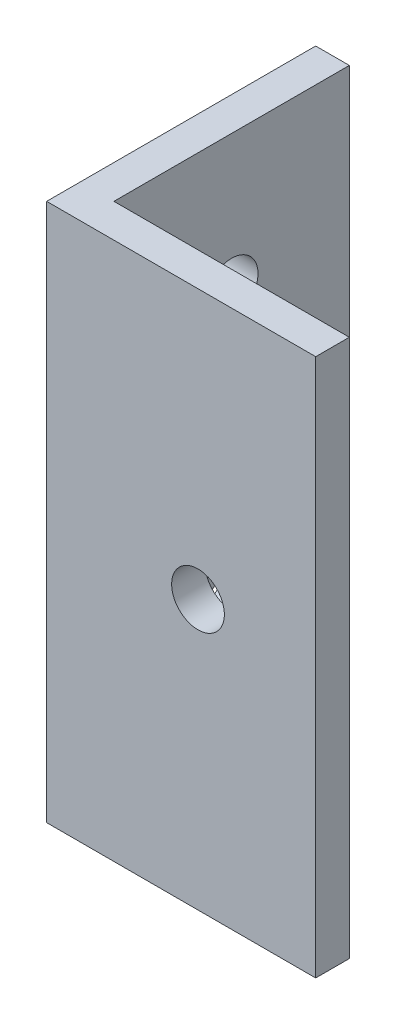
ISO-10303-21;
HEADER;
FILE_DESCRIPTION(('STEP AP214'),'2;1');
FILE_NAME('part.step','',(''),(''),'','','');
FILE_SCHEMA(('AUTOMOTIVE_DESIGN { 1 0 10303 214 1 1 1 1 }'));
ENDSEC;
DATA;
#1=APPLICATION_CONTEXT('core data for automotive mechanical design processes');
#2=APPLICATION_PROTOCOL_DEFINITION('international standard','automotive_design',2000,#1);
#3=PRODUCT_CONTEXT('',#1,'mechanical');
#4=PRODUCT('Part','Part','',(#3));
#5=PRODUCT_RELATED_PRODUCT_CATEGORY('part','',(#4));
#6=PRODUCT_DEFINITION_FORMATION('','',#4);
#7=PRODUCT_DEFINITION_CONTEXT('part definition',#1,'design');
#8=PRODUCT_DEFINITION('design','',#6,#7);
#9=PRODUCT_DEFINITION_SHAPE('','',#8);
#10=(LENGTH_UNIT() NAMED_UNIT(*) SI_UNIT(.MILLI.,.METRE.));
#11=(NAMED_UNIT(*) PLANE_ANGLE_UNIT() SI_UNIT($,.RADIAN.));
#12=(NAMED_UNIT(*) SI_UNIT($,.STERADIAN.) SOLID_ANGLE_UNIT());
#13=UNCERTAINTY_MEASURE_WITH_UNIT(LENGTH_MEASURE(1.E-05),#10,'distance_accuracy_value','');
#14=(GEOMETRIC_REPRESENTATION_CONTEXT(3) GLOBAL_UNCERTAINTY_ASSIGNED_CONTEXT((#13)) GLOBAL_UNIT_ASSIGNED_CONTEXT((#10,
#11,#12)) REPRESENTATION_CONTEXT('',''));
#15=CARTESIAN_POINT('',(0.,0.,0.));
#16=DIRECTION('',(0.,0.,1.));
#17=DIRECTION('',(1.,0.,0.));
#18=AXIS2_PLACEMENT_3D('',#15,#16,#17);
#19=CARTESIAN_POINT('',(0.,50.8,0.));
#20=DIRECTION('',(1.,0.,0.));
#21=DIRECTION('',(0.,0.,-1.));
#22=AXIS2_PLACEMENT_3D('',#19,#20,#21);
#23=PLANE('',#22);
#24=CARTESIAN_POINT('',(0.,12.7,-14.2875));
#25=DIRECTION('',(1.,0.,0.));
#26=DIRECTION('',(0.,0.,-1.));
#27=AXIS2_PLACEMENT_3D('',#24,#25,#26);
#28=CIRCLE('',#27,2.4892);
#29=CARTESIAN_POINT('',(0.,12.7,-16.7767));
#30=VERTEX_POINT('',#29);
#31=EDGE_CURVE('E162',#30,#30,#28,.T.);
#32=ORIENTED_EDGE('',*,*,#31,.T.);
#33=EDGE_LOOP('',(#32));
#34=FACE_BOUND('',#33,.T.);
#35=CARTESIAN_POINT('',(0.,38.1,-14.2875));
#36=DIRECTION('',(1.,0.,0.));
#37=DIRECTION('',(0.,0.,-1.));
#38=AXIS2_PLACEMENT_3D('',#35,#36,#37);
#39=CIRCLE('',#38,2.4892);
#40=CARTESIAN_POINT('',(0.,38.1,-16.7767));
#41=VERTEX_POINT('',#40);
#42=EDGE_CURVE('E165',#41,#41,#39,.T.);
#43=ORIENTED_EDGE('',*,*,#42,.T.);
#44=EDGE_LOOP('',(#43));
#45=FACE_BOUND('',#44,.T.);
#46=DIRECTION('',(0.,0.,1.));
#47=VECTOR('',#46,1.);
#48=CARTESIAN_POINT('',(0.,0.,0.));
#49=LINE('',#48,#47);
#50=CARTESIAN_POINT('',(0.,0.,-25.4));
#51=VERTEX_POINT('',#50);
#52=CARTESIAN_POINT('',(0.,0.,0.));
#53=VERTEX_POINT('',#52);
#54=EDGE_CURVE('E117',#51,#53,#49,.T.);
#55=ORIENTED_EDGE('',*,*,#54,.T.);
#56=DIRECTION('',(0.,-1.,0.));
#57=VECTOR('',#56,1.);
#58=CARTESIAN_POINT('',(0.,50.8,0.));
#59=LINE('',#58,#57);
#60=CARTESIAN_POINT('',(0.,50.8,0.));
#61=VERTEX_POINT('',#60);
#62=EDGE_CURVE('E11',#61,#53,#59,.T.);
#63=ORIENTED_EDGE('',*,*,#62,.F.);
#64=DIRECTION('',(0.,0.,1.));
#65=VECTOR('',#64,1.);
#66=CARTESIAN_POINT('',(0.,50.8,0.));
#67=LINE('',#66,#65);
#68=CARTESIAN_POINT('',(0.,50.8,-25.4));
#69=VERTEX_POINT('',#68);
#70=EDGE_CURVE('E128',#69,#61,#67,.T.);
#71=ORIENTED_EDGE('',*,*,#70,.F.);
#72=DIRECTION('',(0.,-1.,0.));
#73=VECTOR('',#72,1.);
#74=CARTESIAN_POINT('',(0.,50.8,-25.4));
#75=LINE('',#74,#73);
#76=EDGE_CURVE('E113',#69,#51,#75,.T.);
#77=ORIENTED_EDGE('',*,*,#76,.T.);
#78=EDGE_LOOP('',(#55,#63,#71,#77));
#79=FACE_BOUND('',#78,.T.);
#80=ADVANCED_FACE('F33',(#34,#45,#79),#23,.F.);
#81=CARTESIAN_POINT('',(0.,50.8,0.));
#82=DIRECTION('',(0.,0.,-1.));
#83=DIRECTION('',(-1.,0.,0.));
#84=AXIS2_PLACEMENT_3D('',#81,#82,#83);
#85=PLANE('',#84);
#86=CARTESIAN_POINT('',(14.2875,25.4,0.));
#87=DIRECTION('',(0.,0.,-1.));
#88=DIRECTION('',(-1.,0.,0.));
#89=AXIS2_PLACEMENT_3D('',#86,#87,#88);
#90=CIRCLE('',#89,2.4892);
#91=CARTESIAN_POINT('',(11.7983,25.4,0.));
#92=VERTEX_POINT('',#91);
#93=EDGE_CURVE('E121',#92,#92,#90,.T.);
#94=ORIENTED_EDGE('',*,*,#93,.T.);
#95=EDGE_LOOP('',(#94));
#96=FACE_BOUND('',#95,.T.);
#97=DIRECTION('',(1.,0.,0.));
#98=VECTOR('',#97,1.);
#99=CARTESIAN_POINT('',(0.,0.,0.));
#100=LINE('',#99,#98);
#101=CARTESIAN_POINT('',(25.4,0.,0.));
#102=VERTEX_POINT('',#101);
#103=EDGE_CURVE('E120',#53,#102,#100,.T.);
#104=ORIENTED_EDGE('',*,*,#103,.T.);
#105=DIRECTION('',(0.,-1.,0.));
#106=VECTOR('',#105,1.);
#107=CARTESIAN_POINT('',(25.4,50.8,0.));
#108=LINE('',#107,#106);
#109=CARTESIAN_POINT('',(25.4,50.8,0.));
#110=VERTEX_POINT('',#109);
#111=EDGE_CURVE('E41',#110,#102,#108,.T.);
#112=ORIENTED_EDGE('',*,*,#111,.F.);
#113=DIRECTION('',(1.,0.,0.));
#114=VECTOR('',#113,1.);
#115=CARTESIAN_POINT('',(0.,50.8,0.));
#116=LINE('',#115,#114);
#117=EDGE_CURVE('E86',#61,#110,#116,.T.);
#118=ORIENTED_EDGE('',*,*,#117,.F.);
#119=ORIENTED_EDGE('',*,*,#62,.T.);
#120=EDGE_LOOP('',(#104,#112,#118,#119));
#121=FACE_BOUND('',#120,.T.);
#122=ADVANCED_FACE('F153',(#96,#121),#85,.F.);
#123=CARTESIAN_POINT('',(25.4,50.8,0.));
#124=DIRECTION('',(-1.,0.,0.));
#125=DIRECTION('',(0.,0.,1.));
#126=AXIS2_PLACEMENT_3D('',#123,#124,#125);
#127=PLANE('',#126);
#128=DIRECTION('',(0.,0.,-1.));
#129=VECTOR('',#128,1.);
#130=CARTESIAN_POINT('',(25.4,0.,0.));
#131=LINE('',#130,#129);
#132=CARTESIAN_POINT('',(25.4,0.,-3.175));
#133=VERTEX_POINT('',#132);
#134=EDGE_CURVE('E123',#102,#133,#131,.T.);
#135=ORIENTED_EDGE('',*,*,#134,.T.);
#136=DIRECTION('',(0.,-1.,0.));
#137=VECTOR('',#136,1.);
#138=CARTESIAN_POINT('',(25.4,50.8,-3.175));
#139=LINE('',#138,#137);
#140=CARTESIAN_POINT('',(25.4,50.8,-3.175));
#141=VERTEX_POINT('',#140);
#142=EDGE_CURVE('E108',#141,#133,#139,.T.);
#143=ORIENTED_EDGE('',*,*,#142,.F.);
#144=DIRECTION('',(0.,0.,-1.));
#145=VECTOR('',#144,1.);
#146=CARTESIAN_POINT('',(25.4,50.8,0.));
#147=LINE('',#146,#145);
#148=EDGE_CURVE('E99',#110,#141,#147,.T.);
#149=ORIENTED_EDGE('',*,*,#148,.F.);
#150=ORIENTED_EDGE('',*,*,#111,.T.);
#151=EDGE_LOOP('',(#135,#143,#149,#150));
#152=FACE_BOUND('',#151,.T.);
#153=ADVANCED_FACE('F134',(#152),#127,.F.);
#154=CARTESIAN_POINT('',(3.175,50.8,-3.175));
#155=DIRECTION('',(0.,0.,1.));
#156=DIRECTION('',(1.,0.,0.));
#157=AXIS2_PLACEMENT_3D('',#154,#155,#156);
#158=PLANE('',#157);
#159=CARTESIAN_POINT('',(14.2875,25.4,-3.175));
#160=DIRECTION('',(0.,0.,-1.));
#161=DIRECTION('',(-1.,0.,0.));
#162=AXIS2_PLACEMENT_3D('',#159,#160,#161);
#163=CIRCLE('',#162,2.4892);
#164=CARTESIAN_POINT('',(11.7983,25.4,-3.175));
#165=VERTEX_POINT('',#164);
#166=EDGE_CURVE('E178',#165,#165,#163,.T.);
#167=ORIENTED_EDGE('',*,*,#166,.F.);
#168=EDGE_LOOP('',(#167));
#169=FACE_BOUND('',#168,.T.);
#170=DIRECTION('',(-1.,0.,0.));
#171=VECTOR('',#170,1.);
#172=CARTESIAN_POINT('',(3.175,0.,-3.175));
#173=LINE('',#172,#171);
#174=CARTESIAN_POINT('',(3.175,0.,-3.175));
#175=VERTEX_POINT('',#174);
#176=EDGE_CURVE('E107',#133,#175,#173,.T.);
#177=ORIENTED_EDGE('',*,*,#176,.T.);
#178=DIRECTION('',(0.,-1.,0.));
#179=VECTOR('',#178,1.);
#180=CARTESIAN_POINT('',(3.175,50.8,-3.175));
#181=LINE('',#180,#179);
#182=CARTESIAN_POINT('',(3.175,50.8,-3.175));
#183=VERTEX_POINT('',#182);
#184=EDGE_CURVE('E104',#183,#175,#181,.T.);
#185=ORIENTED_EDGE('',*,*,#184,.F.);
#186=DIRECTION('',(-1.,0.,0.));
#187=VECTOR('',#186,1.);
#188=CARTESIAN_POINT('',(3.175,50.8,-3.175));
#189=LINE('',#188,#187);
#190=EDGE_CURVE('E93',#141,#183,#189,.T.);
#191=ORIENTED_EDGE('',*,*,#190,.F.);
#192=ORIENTED_EDGE('',*,*,#142,.T.);
#193=EDGE_LOOP('',(#177,#185,#191,#192));
#194=FACE_BOUND('',#193,.T.);
#195=ADVANCED_FACE('F105',(#169,#194),#158,.F.);
#196=CARTESIAN_POINT('',(3.175,50.8,-3.175));
#197=DIRECTION('',(-1.,0.,0.));
#198=DIRECTION('',(0.,0.,1.));
#199=AXIS2_PLACEMENT_3D('',#196,#197,#198);
#200=PLANE('',#199);
#201=CARTESIAN_POINT('',(3.175,12.7,-14.2875));
#202=DIRECTION('',(1.,0.,0.));
#203=DIRECTION('',(0.,0.,-1.));
#204=AXIS2_PLACEMENT_3D('',#201,#202,#203);
#205=CIRCLE('',#204,2.4892);
#206=CARTESIAN_POINT('',(3.175,12.7,-16.7767));
#207=VERTEX_POINT('',#206);
#208=EDGE_CURVE('E167',#207,#207,#205,.T.);
#209=ORIENTED_EDGE('',*,*,#208,.F.);
#210=EDGE_LOOP('',(#209));
#211=FACE_BOUND('',#210,.T.);
#212=CARTESIAN_POINT('',(3.175,38.1,-14.2875));
#213=DIRECTION('',(1.,0.,0.));
#214=DIRECTION('',(0.,0.,-1.));
#215=AXIS2_PLACEMENT_3D('',#212,#213,#214);
#216=CIRCLE('',#215,2.4892);
#217=CARTESIAN_POINT('',(3.175,38.1,-16.7767));
#218=VERTEX_POINT('',#217);
#219=EDGE_CURVE('E168',#218,#218,#216,.T.);
#220=ORIENTED_EDGE('',*,*,#219,.F.);
#221=EDGE_LOOP('',(#220));
#222=FACE_BOUND('',#221,.T.);
#223=DIRECTION('',(0.,0.,-1.));
#224=VECTOR('',#223,1.);
#225=CARTESIAN_POINT('',(3.175,0.,-3.175));
#226=LINE('',#225,#224);
#227=CARTESIAN_POINT('',(3.175,0.,-25.4));
#228=VERTEX_POINT('',#227);
#229=EDGE_CURVE('E72',#175,#228,#226,.T.);
#230=ORIENTED_EDGE('',*,*,#229,.T.);
#231=DIRECTION('',(0.,-1.,0.));
#232=VECTOR('',#231,1.);
#233=CARTESIAN_POINT('',(3.175,50.8,-25.4));
#234=LINE('',#233,#232);
#235=CARTESIAN_POINT('',(3.175,50.8,-25.4));
#236=VERTEX_POINT('',#235);
#237=EDGE_CURVE('E109',#236,#228,#234,.T.);
#238=ORIENTED_EDGE('',*,*,#237,.F.);
#239=DIRECTION('',(0.,0.,-1.));
#240=VECTOR('',#239,1.);
#241=CARTESIAN_POINT('',(3.175,50.8,-3.175));
#242=LINE('',#241,#240);
#243=EDGE_CURVE('E97',#183,#236,#242,.T.);
#244=ORIENTED_EDGE('',*,*,#243,.F.);
#245=ORIENTED_EDGE('',*,*,#184,.T.);
#246=EDGE_LOOP('',(#230,#238,#244,#245));
#247=FACE_BOUND('',#246,.T.);
#248=ADVANCED_FACE('F111',(#211,#222,#247),#200,.F.);
#249=CARTESIAN_POINT('',(0.,50.8,-25.4));
#250=DIRECTION('',(0.,0.,1.));
#251=DIRECTION('',(1.,0.,0.));
#252=AXIS2_PLACEMENT_3D('',#249,#250,#251);
#253=PLANE('',#252);
#254=DIRECTION('',(-1.,0.,0.));
#255=VECTOR('',#254,1.);
#256=CARTESIAN_POINT('',(0.,0.,-25.4));
#257=LINE('',#256,#255);
#258=EDGE_CURVE('E78',#228,#51,#257,.T.);
#259=ORIENTED_EDGE('',*,*,#258,.T.);
#260=ORIENTED_EDGE('',*,*,#76,.F.);
#261=DIRECTION('',(-1.,0.,0.));
#262=VECTOR('',#261,1.);
#263=CARTESIAN_POINT('',(0.,50.8,-25.4));
#264=LINE('',#263,#262);
#265=EDGE_CURVE('E49',#236,#69,#264,.T.);
#266=ORIENTED_EDGE('',*,*,#265,.F.);
#267=ORIENTED_EDGE('',*,*,#237,.T.);
#268=EDGE_LOOP('',(#259,#260,#266,#267));
#269=FACE_BOUND('',#268,.T.);
#270=ADVANCED_FACE('F141',(#269),#253,.F.);
#271=CARTESIAN_POINT('',(0.,50.8,0.));
#272=DIRECTION('',(0.,-1.,0.));
#273=DIRECTION('',(0.,0.,-1.));
#274=AXIS2_PLACEMENT_3D('',#271,#272,#273);
#275=PLANE('',#274);
#276=ORIENTED_EDGE('',*,*,#70,.T.);
#277=ORIENTED_EDGE('',*,*,#117,.T.);
#278=ORIENTED_EDGE('',*,*,#148,.T.);
#279=ORIENTED_EDGE('',*,*,#190,.T.);
#280=ORIENTED_EDGE('',*,*,#243,.T.);
#281=ORIENTED_EDGE('',*,*,#265,.T.);
#282=EDGE_LOOP('',(#276,#277,#278,#279,#280,#281));
#283=FACE_BOUND('',#282,.T.);
#284=ADVANCED_FACE('F95',(#283),#275,.F.);
#285=CARTESIAN_POINT('',(0.,0.,0.));
#286=DIRECTION('',(0.,-1.,0.));
#287=DIRECTION('',(0.,0.,-1.));
#288=AXIS2_PLACEMENT_3D('',#285,#286,#287);
#289=PLANE('',#288);
#290=ORIENTED_EDGE('',*,*,#54,.F.);
#291=ORIENTED_EDGE('',*,*,#258,.F.);
#292=ORIENTED_EDGE('',*,*,#229,.F.);
#293=ORIENTED_EDGE('',*,*,#176,.F.);
#294=ORIENTED_EDGE('',*,*,#134,.F.);
#295=ORIENTED_EDGE('',*,*,#103,.F.);
#296=EDGE_LOOP('',(#290,#291,#292,#293,#294,#295));
#297=FACE_BOUND('',#296,.T.);
#298=ADVANCED_FACE('F137',(#297),#289,.T.);
#299=CARTESIAN_POINT('',(14.2875,25.4,0.));
#300=DIRECTION('',(0.,0.,-1.));
#301=DIRECTION('',(-1.,0.,0.));
#302=AXIS2_PLACEMENT_3D('',#299,#300,#301);
#303=CYLINDRICAL_SURFACE('',#302,2.4892);
#304=ORIENTED_EDGE('',*,*,#93,.F.);
#305=EDGE_LOOP('',(#304));
#306=FACE_BOUND('',#305,.T.);
#307=ORIENTED_EDGE('',*,*,#166,.T.);
#308=EDGE_LOOP('',(#307));
#309=FACE_BOUND('',#308,.T.);
#310=ADVANCED_FACE('F184',(#306,#309),#303,.F.);
#311=CARTESIAN_POINT('',(0.,38.1,-14.2875));
#312=DIRECTION('',(1.,0.,0.));
#313=DIRECTION('',(0.,0.,-1.));
#314=AXIS2_PLACEMENT_3D('',#311,#312,#313);
#315=CYLINDRICAL_SURFACE('',#314,2.4892);
#316=ORIENTED_EDGE('',*,*,#42,.F.);
#317=EDGE_LOOP('',(#316));
#318=FACE_BOUND('',#317,.T.);
#319=ORIENTED_EDGE('',*,*,#219,.T.);
#320=EDGE_LOOP('',(#319));
#321=FACE_BOUND('',#320,.T.);
#322=ADVANCED_FACE('F217',(#318,#321),#315,.F.);
#323=CARTESIAN_POINT('',(0.,12.7,-14.2875));
#324=DIRECTION('',(1.,0.,0.));
#325=DIRECTION('',(0.,0.,-1.));
#326=AXIS2_PLACEMENT_3D('',#323,#324,#325);
#327=CYLINDRICAL_SURFACE('',#326,2.4892);
#328=ORIENTED_EDGE('',*,*,#31,.F.);
#329=EDGE_LOOP('',(#328));
#330=FACE_BOUND('',#329,.T.);
#331=ORIENTED_EDGE('',*,*,#208,.T.);
#332=EDGE_LOOP('',(#331));
#333=FACE_BOUND('',#332,.T.);
#334=ADVANCED_FACE('F237',(#330,#333),#327,.F.);
#335=CLOSED_SHELL('',(#80,#122,#153,#195,#248,#270,#284,#298,#310,#322,#334));
#336=MANIFOLD_SOLID_BREP('B2',#335);
#337=ADVANCED_BREP_SHAPE_REPRESENTATION('',(#18,#336),#14);
#338=SHAPE_DEFINITION_REPRESENTATION(#9,#337);
ENDSEC;
END-ISO-10303-21;
